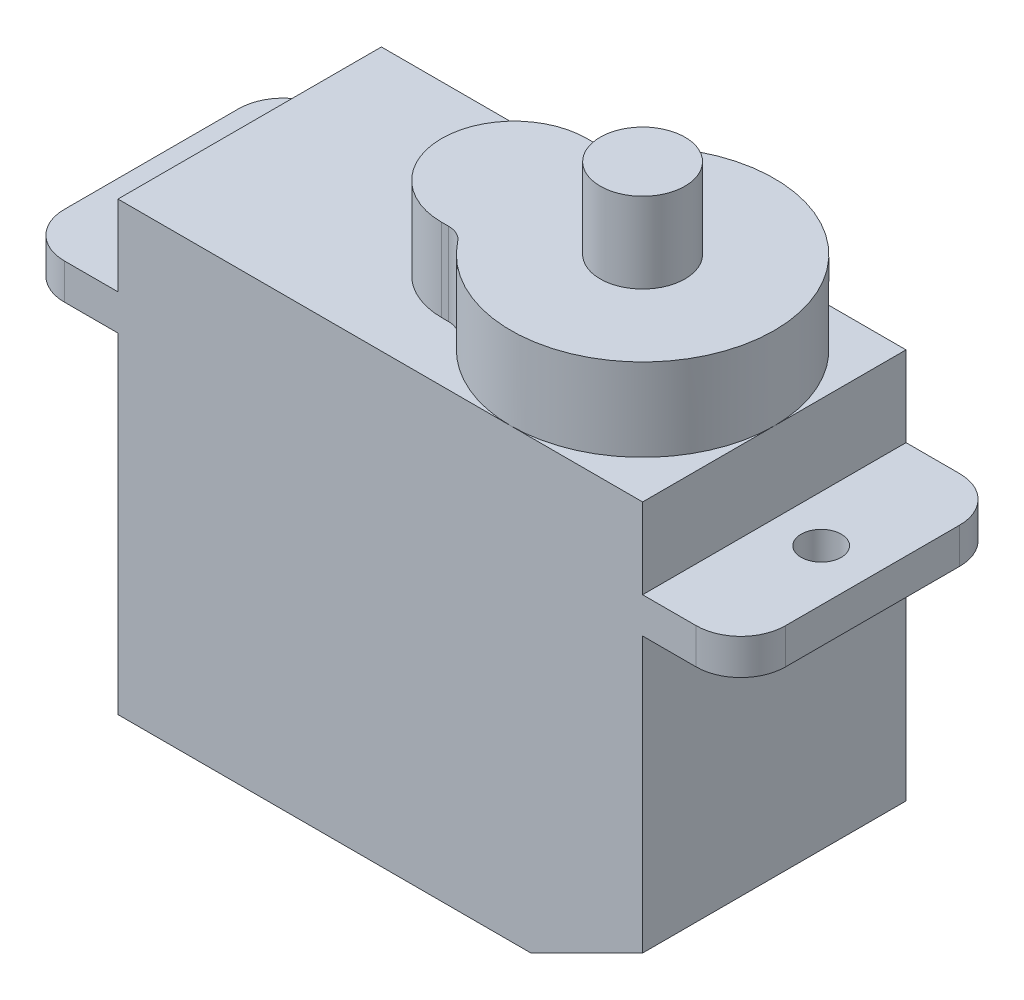
ISO-10303-21;
HEADER;
FILE_DESCRIPTION(('STEP AP214'),'2;1');
FILE_NAME('part.step','',(''),(''),'','','');
FILE_SCHEMA(('AUTOMOTIVE_DESIGN { 1 0 10303 214 1 1 1 1 }'));
ENDSEC;
DATA;
#1=APPLICATION_CONTEXT('core data for automotive mechanical design processes');
#2=APPLICATION_PROTOCOL_DEFINITION('international standard','automotive_design',2000,#1);
#3=PRODUCT_CONTEXT('',#1,'mechanical');
#4=PRODUCT('Part','Part','',(#3));
#5=PRODUCT_RELATED_PRODUCT_CATEGORY('part','',(#4));
#6=PRODUCT_DEFINITION_FORMATION('','',#4);
#7=PRODUCT_DEFINITION_CONTEXT('part definition',#1,'design');
#8=PRODUCT_DEFINITION('design','',#6,#7);
#9=PRODUCT_DEFINITION_SHAPE('','',#8);
#10=(LENGTH_UNIT() NAMED_UNIT(*) SI_UNIT(.MILLI.,.METRE.));
#11=(NAMED_UNIT(*) PLANE_ANGLE_UNIT() SI_UNIT($,.RADIAN.));
#12=(NAMED_UNIT(*) SI_UNIT($,.STERADIAN.) SOLID_ANGLE_UNIT());
#13=UNCERTAINTY_MEASURE_WITH_UNIT(LENGTH_MEASURE(1.E-05),#10,'distance_accuracy_value','');
#14=(GEOMETRIC_REPRESENTATION_CONTEXT(3) GLOBAL_UNCERTAINTY_ASSIGNED_CONTEXT((#13)) GLOBAL_UNIT_ASSIGNED_CONTEXT((#10,
#11,#12)) REPRESENTATION_CONTEXT('',''));
#15=CARTESIAN_POINT('',(0.,0.,0.));
#16=DIRECTION('',(0.,0.,1.));
#17=DIRECTION('',(1.,0.,0.));
#18=AXIS2_PLACEMENT_3D('',#15,#16,#17);
#19=CARTESIAN_POINT('',(0.,20.,11.8));
#20=DIRECTION('',(0.,1.,0.));
#21=DIRECTION('',(0.,0.,1.));
#22=AXIS2_PLACEMENT_3D('',#19,#20,#21);
#23=PLANE('',#22);
#24=CARTESIAN_POINT('',(12.1642387837581,20.,10.15));
#25=DIRECTION('',(0.,-1.,0.));
#26=DIRECTION('',(0.,0.,1.));
#27=AXIS2_PLACEMENT_3D('',#24,#25,#26);
#28=CIRCLE('',#27,1.);
#29=CARTESIAN_POINT('',(12.1642387837581,20.,9.15));
#30=VERTEX_POINT('',#29);
#31=CARTESIAN_POINT('',(12.9520302643728,20.,9.53405797101449));
#32=VERTEX_POINT('',#31);
#33=EDGE_CURVE('E50',#30,#32,#28,.T.);
#34=ORIENTED_EDGE('',*,*,#33,.F.);
#35=DIRECTION('',(1.,0.,0.));
#36=VECTOR('',#35,1.);
#37=CARTESIAN_POINT('',(11.85,20.,9.15));
#38=LINE('',#37,#36);
#39=CARTESIAN_POINT('',(11.85,20.,9.15));
#40=VERTEX_POINT('',#39);
#41=EDGE_CURVE('E54',#40,#30,#38,.T.);
#42=ORIENTED_EDGE('',*,*,#41,.F.);
#43=CARTESIAN_POINT('',(11.85,20.,5.9));
#44=DIRECTION('',(0.,1.,0.));
#45=DIRECTION('',(0.,0.,1.));
#46=AXIS2_PLACEMENT_3D('',#43,#44,#45);
#47=CIRCLE('',#46,3.25);
#48=CARTESIAN_POINT('',(11.85,20.,2.65));
#49=VERTEX_POINT('',#48);
#50=EDGE_CURVE('E741',#49,#40,#47,.T.);
#51=ORIENTED_EDGE('',*,*,#50,.F.);
#52=DIRECTION('',(-1.,0.,0.));
#53=VECTOR('',#52,1.);
#54=CARTESIAN_POINT('',(11.85,20.,2.65));
#55=LINE('',#54,#53);
#56=CARTESIAN_POINT('',(12.1642387837581,20.,2.65));
#57=VERTEX_POINT('',#56);
#58=EDGE_CURVE('E378',#57,#49,#55,.T.);
#59=ORIENTED_EDGE('',*,*,#58,.F.);
#60=CARTESIAN_POINT('',(12.1642387837581,20.,1.65));
#61=DIRECTION('',(0.,-1.,0.));
#62=DIRECTION('',(0.,0.,-1.));
#63=AXIS2_PLACEMENT_3D('',#60,#61,#62);
#64=CIRCLE('',#63,0.999999999999999);
#65=CARTESIAN_POINT('',(12.9520302643728,20.,2.26594202898551));
#66=VERTEX_POINT('',#65);
#67=EDGE_CURVE('E376',#66,#57,#64,.T.);
#68=ORIENTED_EDGE('',*,*,#67,.F.);
#69=CARTESIAN_POINT('',(17.6,20.,5.9));
#70=DIRECTION('',(0.,1.,0.));
#71=DIRECTION('',(0.,0.,1.));
#72=AXIS2_PLACEMENT_3D('',#69,#70,#71);
#73=CIRCLE('',#72,5.9);
#74=CARTESIAN_POINT('',(17.6,20.,0.));
#75=VERTEX_POINT('',#74);
#76=EDGE_CURVE('E370',#75,#66,#73,.T.);
#77=ORIENTED_EDGE('',*,*,#76,.F.);
#78=DIRECTION('',(1.,0.,0.));
#79=VECTOR('',#78,1.);
#80=CARTESIAN_POINT('',(0.,20.,0.));
#81=LINE('',#80,#79);
#82=CARTESIAN_POINT('',(0.,20.,0.));
#83=VERTEX_POINT('',#82);
#84=EDGE_CURVE('E275',#83,#75,#81,.T.);
#85=ORIENTED_EDGE('',*,*,#84,.F.);
#86=DIRECTION('',(0.,0.,-1.));
#87=VECTOR('',#86,1.);
#88=CARTESIAN_POINT('',(0.,20.,11.8));
#89=LINE('',#88,#87);
#90=CARTESIAN_POINT('',(0.,20.,11.8));
#91=VERTEX_POINT('',#90);
#92=EDGE_CURVE('E330',#91,#83,#89,.T.);
#93=ORIENTED_EDGE('',*,*,#92,.F.);
#94=DIRECTION('',(1.,0.,0.));
#95=VECTOR('',#94,1.);
#96=CARTESIAN_POINT('',(0.,20.,11.8));
#97=LINE('',#96,#95);
#98=CARTESIAN_POINT('',(17.6,20.,11.8));
#99=VERTEX_POINT('',#98);
#100=EDGE_CURVE('E242',#91,#99,#97,.T.);
#101=ORIENTED_EDGE('',*,*,#100,.T.);
#102=EDGE_CURVE('E43',#32,#99,#73,.T.);
#103=ORIENTED_EDGE('',*,*,#102,.F.);
#104=EDGE_LOOP('',(#34,#42,#51,#59,#68,#77,#85,#93,#101,#103));
#105=FACE_BOUND('',#104,.T.);
#106=ADVANCED_FACE('F32',(#105),#23,.T.);
#107=CARTESIAN_POINT('',(23.5,20.,5.9));
#108=VERTEX_POINT('',#107);
#109=EDGE_CURVE('E11',#99,#108,#73,.T.);
#110=ORIENTED_EDGE('',*,*,#109,.F.);
#111=CARTESIAN_POINT('',(23.5,20.,11.8));
#112=VERTEX_POINT('',#111);
#113=EDGE_CURVE('E241',#99,#112,#97,.T.);
#114=ORIENTED_EDGE('',*,*,#113,.T.);
#115=DIRECTION('',(0.,0.,-1.));
#116=VECTOR('',#115,1.);
#117=CARTESIAN_POINT('',(23.5,20.,11.8));
#118=LINE('',#117,#116);
#119=EDGE_CURVE('E326',#112,#108,#118,.T.);
#120=ORIENTED_EDGE('',*,*,#119,.T.);
#121=EDGE_LOOP('',(#110,#114,#120));
#122=FACE_BOUND('',#121,.T.);
#123=ADVANCED_FACE('F410',(#122),#23,.T.);
#124=CARTESIAN_POINT('',(-4.4,16.4,11.8));
#125=DIRECTION('',(0.,1.,0.));
#126=DIRECTION('',(0.,0.,1.));
#127=AXIS2_PLACEMENT_3D('',#124,#125,#126);
#128=PLANE('',#127);
#129=CARTESIAN_POINT('',(-2.1,16.4,5.9));
#130=DIRECTION('',(0.,1.,0.));
#131=DIRECTION('',(-1.,0.,0.));
#132=AXIS2_PLACEMENT_3D('',#129,#130,#131);
#133=CIRCLE('',#132,0.9);
#134=CARTESIAN_POINT('',(-3.,16.4,5.9));
#135=VERTEX_POINT('',#134);
#136=EDGE_CURVE('E231',#135,#135,#133,.T.);
#137=ORIENTED_EDGE('',*,*,#136,.F.);
#138=EDGE_LOOP('',(#137));
#139=FACE_BOUND('',#138,.T.);
#140=DIRECTION('',(0.,0.,-1.));
#141=VECTOR('',#140,1.);
#142=CARTESIAN_POINT('',(-4.4,16.4,11.8));
#143=LINE('',#142,#141);
#144=CARTESIAN_POINT('',(-4.4,16.4,9.8));
#145=VERTEX_POINT('',#144);
#146=CARTESIAN_POINT('',(-4.4,16.4,2.));
#147=VERTEX_POINT('',#146);
#148=EDGE_CURVE('E300',#145,#147,#143,.T.);
#149=ORIENTED_EDGE('',*,*,#148,.F.);
#150=CARTESIAN_POINT('',(-2.4,16.4,9.8));
#151=DIRECTION('',(0.,1.,0.));
#152=DIRECTION('',(0.,0.,1.));
#153=AXIS2_PLACEMENT_3D('',#150,#151,#152);
#154=CIRCLE('',#153,2.);
#155=CARTESIAN_POINT('',(-2.4,16.4,11.8));
#156=VERTEX_POINT('',#155);
#157=EDGE_CURVE('E365',#145,#156,#154,.T.);
#158=ORIENTED_EDGE('',*,*,#157,.T.);
#159=DIRECTION('',(1.,0.,0.));
#160=VECTOR('',#159,1.);
#161=CARTESIAN_POINT('',(-4.4,16.4,11.8));
#162=LINE('',#161,#160);
#163=CARTESIAN_POINT('',(0.,16.4,11.8));
#164=VERTEX_POINT('',#163);
#165=EDGE_CURVE('E235',#156,#164,#162,.T.);
#166=ORIENTED_EDGE('',*,*,#165,.T.);
#167=DIRECTION('',(0.,0.,-1.));
#168=VECTOR('',#167,1.);
#169=CARTESIAN_POINT('',(0.,16.4,11.8));
#170=LINE('',#169,#168);
#171=CARTESIAN_POINT('',(0.,16.4,0.));
#172=VERTEX_POINT('',#171);
#173=EDGE_CURVE('E268',#164,#172,#170,.T.);
#174=ORIENTED_EDGE('',*,*,#173,.T.);
#175=DIRECTION('',(1.,0.,0.));
#176=VECTOR('',#175,1.);
#177=CARTESIAN_POINT('',(-4.4,16.4,0.));
#178=LINE('',#177,#176);
#179=CARTESIAN_POINT('',(-2.4,16.4,0.));
#180=VERTEX_POINT('',#179);
#181=EDGE_CURVE('E269',#180,#172,#178,.T.);
#182=ORIENTED_EDGE('',*,*,#181,.F.);
#183=CARTESIAN_POINT('',(-2.4,16.4,2.));
#184=DIRECTION('',(0.,1.,0.));
#185=DIRECTION('',(0.,0.,1.));
#186=AXIS2_PLACEMENT_3D('',#183,#184,#185);
#187=CIRCLE('',#186,2.);
#188=EDGE_CURVE('E363',#180,#147,#187,.T.);
#189=ORIENTED_EDGE('',*,*,#188,.T.);
#190=EDGE_LOOP('',(#149,#158,#166,#174,#182,#189));
#191=FACE_BOUND('',#190,.T.);
#192=ADVANCED_FACE('F416',(#139,#191),#128,.T.);
#193=CARTESIAN_POINT('',(-4.4,14.8,11.8));
#194=DIRECTION('',(-1.,0.,0.));
#195=DIRECTION('',(0.,0.,1.));
#196=AXIS2_PLACEMENT_3D('',#193,#194,#195);
#197=PLANE('',#196);
#198=DIRECTION('',(0.,0.,-1.));
#199=VECTOR('',#198,1.);
#200=CARTESIAN_POINT('',(-4.4,14.8,11.8));
#201=LINE('',#200,#199);
#202=CARTESIAN_POINT('',(-4.4,14.8,9.8));
#203=VERTEX_POINT('',#202);
#204=CARTESIAN_POINT('',(-4.4,14.8,2.));
#205=VERTEX_POINT('',#204);
#206=EDGE_CURVE('E304',#203,#205,#201,.T.);
#207=ORIENTED_EDGE('',*,*,#206,.F.);
#208=DIRECTION('',(0.,1.,0.));
#209=VECTOR('',#208,1.);
#210=CARTESIAN_POINT('',(-4.4,14.8,9.8));
#211=LINE('',#210,#209);
#212=EDGE_CURVE('E360',#203,#145,#211,.T.);
#213=ORIENTED_EDGE('',*,*,#212,.T.);
#214=ORIENTED_EDGE('',*,*,#148,.T.);
#215=DIRECTION('',(0.,1.,0.));
#216=VECTOR('',#215,1.);
#217=CARTESIAN_POINT('',(-4.4,14.8,2.));
#218=LINE('',#217,#216);
#219=EDGE_CURVE('E358',#147,#205,#218,.F.);
#220=ORIENTED_EDGE('',*,*,#219,.T.);
#221=EDGE_LOOP('',(#207,#213,#214,#220));
#222=FACE_BOUND('',#221,.T.);
#223=ADVANCED_FACE('F456',(#222),#197,.T.);
#224=CARTESIAN_POINT('',(0.,14.8,11.8));
#225=DIRECTION('',(0.,-1.,0.));
#226=DIRECTION('',(0.,0.,-1.));
#227=AXIS2_PLACEMENT_3D('',#224,#225,#226);
#228=PLANE('',#227);
#229=CARTESIAN_POINT('',(-2.1,14.8,5.9));
#230=DIRECTION('',(0.,-1.,0.));
#231=DIRECTION('',(0.,0.,-1.));
#232=AXIS2_PLACEMENT_3D('',#229,#230,#231);
#233=CIRCLE('',#232,0.9);
#234=CARTESIAN_POINT('',(-2.1,14.8,5.00000000000001));
#235=VERTEX_POINT('',#234);
#236=EDGE_CURVE('E234',#235,#235,#233,.T.);
#237=ORIENTED_EDGE('',*,*,#236,.F.);
#238=EDGE_LOOP('',(#237));
#239=FACE_BOUND('',#238,.T.);
#240=DIRECTION('',(-1.,0.,0.));
#241=VECTOR('',#240,1.);
#242=CARTESIAN_POINT('',(0.,14.8,11.8));
#243=LINE('',#242,#241);
#244=CARTESIAN_POINT('',(0.,14.8,11.8));
#245=VERTEX_POINT('',#244);
#246=CARTESIAN_POINT('',(-2.4,14.8,11.8));
#247=VERTEX_POINT('',#246);
#248=EDGE_CURVE('E265',#245,#247,#243,.T.);
#249=ORIENTED_EDGE('',*,*,#248,.T.);
#250=CARTESIAN_POINT('',(-2.4,14.8,9.8));
#251=DIRECTION('',(0.,-1.,0.));
#252=DIRECTION('',(0.,0.,-1.));
#253=AXIS2_PLACEMENT_3D('',#250,#251,#252);
#254=CIRCLE('',#253,2.);
#255=EDGE_CURVE('E36',#247,#203,#254,.T.);
#256=ORIENTED_EDGE('',*,*,#255,.T.);
#257=ORIENTED_EDGE('',*,*,#206,.T.);
#258=CARTESIAN_POINT('',(-2.4,14.8,2.));
#259=DIRECTION('',(0.,-1.,0.));
#260=DIRECTION('',(0.,0.,-1.));
#261=AXIS2_PLACEMENT_3D('',#258,#259,#260);
#262=CIRCLE('',#261,2.);
#263=CARTESIAN_POINT('',(-2.4,14.8,0.));
#264=VERTEX_POINT('',#263);
#265=EDGE_CURVE('E366',#205,#264,#262,.T.);
#266=ORIENTED_EDGE('',*,*,#265,.T.);
#267=DIRECTION('',(-1.,0.,0.));
#268=VECTOR('',#267,1.);
#269=CARTESIAN_POINT('',(0.,14.8,0.));
#270=LINE('',#269,#268);
#271=CARTESIAN_POINT('',(0.,14.8,0.));
#272=VERTEX_POINT('',#271);
#273=EDGE_CURVE('E238',#272,#264,#270,.T.);
#274=ORIENTED_EDGE('',*,*,#273,.F.);
#275=DIRECTION('',(0.,0.,-1.));
#276=VECTOR('',#275,1.);
#277=CARTESIAN_POINT('',(0.,14.8,11.8));
#278=LINE('',#277,#276);
#279=EDGE_CURVE('E307',#245,#272,#278,.T.);
#280=ORIENTED_EDGE('',*,*,#279,.F.);
#281=EDGE_LOOP('',(#249,#256,#257,#266,#274,#280));
#282=FACE_BOUND('',#281,.T.);
#283=ADVANCED_FACE('F464',(#239,#282),#228,.T.);
#284=CARTESIAN_POINT('',(0.,0.,11.8));
#285=DIRECTION('',(-1.,0.,0.));
#286=DIRECTION('',(0.,0.,1.));
#287=AXIS2_PLACEMENT_3D('',#284,#285,#286);
#288=PLANE('',#287);
#289=DIRECTION('',(0.,1.,0.));
#290=VECTOR('',#289,1.);
#291=CARTESIAN_POINT('',(0.,0.,0.));
#292=LINE('',#291,#290);
#293=CARTESIAN_POINT('',(0.,0.,0.));
#294=VERTEX_POINT('',#293);
#295=EDGE_CURVE('E295',#294,#272,#292,.T.);
#296=ORIENTED_EDGE('',*,*,#295,.F.);
#297=DIRECTION('',(0.,0.,-1.));
#298=VECTOR('',#297,1.);
#299=CARTESIAN_POINT('',(0.,0.,11.8));
#300=LINE('',#299,#298);
#301=CARTESIAN_POINT('',(0.,0.,11.8));
#302=VERTEX_POINT('',#301);
#303=EDGE_CURVE('E309',#302,#294,#300,.T.);
#304=ORIENTED_EDGE('',*,*,#303,.F.);
#305=DIRECTION('',(0.,1.,0.));
#306=VECTOR('',#305,1.);
#307=CARTESIAN_POINT('',(0.,0.,11.8));
#308=LINE('',#307,#306);
#309=EDGE_CURVE('E262',#302,#245,#308,.T.);
#310=ORIENTED_EDGE('',*,*,#309,.T.);
#311=ORIENTED_EDGE('',*,*,#279,.T.);
#312=EDGE_LOOP('',(#296,#304,#310,#311));
#313=FACE_BOUND('',#312,.T.);
#314=ADVANCED_FACE('F468',(#313),#288,.T.);
#315=CARTESIAN_POINT('',(18.5,0.,11.8));
#316=DIRECTION('',(0.,-1.,0.));
#317=DIRECTION('',(0.,0.,-1.));
#318=AXIS2_PLACEMENT_3D('',#315,#316,#317);
#319=PLANE('',#318);
#320=DIRECTION('',(-1.,0.,0.));
#321=VECTOR('',#320,1.);
#322=CARTESIAN_POINT('',(18.5,0.,0.));
#323=LINE('',#322,#321);
#324=CARTESIAN_POINT('',(18.5,0.,0.));
#325=VERTEX_POINT('',#324);
#326=EDGE_CURVE('E292',#325,#294,#323,.T.);
#327=ORIENTED_EDGE('',*,*,#326,.F.);
#328=DIRECTION('',(0.,0.,-1.));
#329=VECTOR('',#328,1.);
#330=CARTESIAN_POINT('',(18.5,0.,11.8));
#331=LINE('',#330,#329);
#332=CARTESIAN_POINT('',(18.5,0.,11.8));
#333=VERTEX_POINT('',#332);
#334=EDGE_CURVE('E311',#333,#325,#331,.T.);
#335=ORIENTED_EDGE('',*,*,#334,.F.);
#336=DIRECTION('',(-1.,0.,0.));
#337=VECTOR('',#336,1.);
#338=CARTESIAN_POINT('',(18.5,0.,11.8));
#339=LINE('',#338,#337);
#340=EDGE_CURVE('E259',#333,#302,#339,.T.);
#341=ORIENTED_EDGE('',*,*,#340,.T.);
#342=ORIENTED_EDGE('',*,*,#303,.T.);
#343=EDGE_LOOP('',(#327,#335,#341,#342));
#344=FACE_BOUND('',#343,.T.);
#345=ADVANCED_FACE('F471',(#344),#319,.T.);
#346=CARTESIAN_POINT('',(23.5,2.5,11.8));
#347=DIRECTION('',(0.447213595499958,-0.894427190999916,0.));
#348=DIRECTION('',(0.894427190999916,0.447213595499958,0.));
#349=AXIS2_PLACEMENT_3D('',#346,#347,#348);
#350=PLANE('',#349);
#351=DIRECTION('',(-0.894427190999916,-0.447213595499958,0.));
#352=VECTOR('',#351,1.);
#353=CARTESIAN_POINT('',(23.5,2.5,0.));
#354=LINE('',#353,#352);
#355=CARTESIAN_POINT('',(23.5,2.5,0.));
#356=VERTEX_POINT('',#355);
#357=EDGE_CURVE('E289',#356,#325,#354,.T.);
#358=ORIENTED_EDGE('',*,*,#357,.F.);
#359=DIRECTION('',(0.,0.,-1.));
#360=VECTOR('',#359,1.);
#361=CARTESIAN_POINT('',(23.5,2.5,11.8));
#362=LINE('',#361,#360);
#363=CARTESIAN_POINT('',(23.5,2.5,11.8));
#364=VERTEX_POINT('',#363);
#365=EDGE_CURVE('E313',#364,#356,#362,.T.);
#366=ORIENTED_EDGE('',*,*,#365,.F.);
#367=DIRECTION('',(-0.894427190999916,-0.447213595499958,0.));
#368=VECTOR('',#367,1.);
#369=CARTESIAN_POINT('',(23.5,2.5,11.8));
#370=LINE('',#369,#368);
#371=EDGE_CURVE('E256',#364,#333,#370,.T.);
#372=ORIENTED_EDGE('',*,*,#371,.T.);
#373=ORIENTED_EDGE('',*,*,#334,.T.);
#374=EDGE_LOOP('',(#358,#366,#372,#373));
#375=FACE_BOUND('',#374,.T.);
#376=ADVANCED_FACE('F476',(#375),#350,.T.);
#377=CARTESIAN_POINT('',(23.5,14.8,11.8));
#378=DIRECTION('',(1.,0.,0.));
#379=DIRECTION('',(0.,1.,0.));
#380=AXIS2_PLACEMENT_3D('',#377,#378,#379);
#381=PLANE('',#380);
#382=DIRECTION('',(0.,-1.,0.));
#383=VECTOR('',#382,1.);
#384=CARTESIAN_POINT('',(23.5,14.8,0.));
#385=LINE('',#384,#383);
#386=CARTESIAN_POINT('',(23.5,14.8,0.));
#387=VERTEX_POINT('',#386);
#388=EDGE_CURVE('E286',#387,#356,#385,.T.);
#389=ORIENTED_EDGE('',*,*,#388,.F.);
#390=DIRECTION('',(0.,0.,-1.));
#391=VECTOR('',#390,1.);
#392=CARTESIAN_POINT('',(23.5,14.8,11.8));
#393=LINE('',#392,#391);
#394=CARTESIAN_POINT('',(23.5,14.8,11.8));
#395=VERTEX_POINT('',#394);
#396=EDGE_CURVE('E315',#395,#387,#393,.T.);
#397=ORIENTED_EDGE('',*,*,#396,.F.);
#398=DIRECTION('',(0.,-1.,0.));
#399=VECTOR('',#398,1.);
#400=CARTESIAN_POINT('',(23.5,14.8,11.8));
#401=LINE('',#400,#399);
#402=EDGE_CURVE('E253',#395,#364,#401,.T.);
#403=ORIENTED_EDGE('',*,*,#402,.T.);
#404=ORIENTED_EDGE('',*,*,#365,.T.);
#405=EDGE_LOOP('',(#389,#397,#403,#404));
#406=FACE_BOUND('',#405,.T.);
#407=ADVANCED_FACE('F479',(#406),#381,.T.);
#408=CARTESIAN_POINT('',(27.9,14.8,11.8));
#409=DIRECTION('',(0.,-1.,0.));
#410=DIRECTION('',(0.,0.,-1.));
#411=AXIS2_PLACEMENT_3D('',#408,#409,#410);
#412=PLANE('',#411);
#413=CARTESIAN_POINT('',(25.6,14.8,5.9));
#414=DIRECTION('',(0.,-1.,0.));
#415=DIRECTION('',(0.,0.,-1.));
#416=AXIS2_PLACEMENT_3D('',#413,#414,#415);
#417=CIRCLE('',#416,0.9);
#418=CARTESIAN_POINT('',(25.6,14.8,5.));
#419=VERTEX_POINT('',#418);
#420=EDGE_CURVE('E223',#419,#419,#417,.T.);
#421=ORIENTED_EDGE('',*,*,#420,.F.);
#422=EDGE_LOOP('',(#421));
#423=FACE_BOUND('',#422,.T.);
#424=DIRECTION('',(0.,0.,-1.));
#425=VECTOR('',#424,1.);
#426=CARTESIAN_POINT('',(27.9,14.8,11.8));
#427=LINE('',#426,#425);
#428=CARTESIAN_POINT('',(27.9,14.8,9.8));
#429=VERTEX_POINT('',#428);
#430=CARTESIAN_POINT('',(27.9,14.8,2.));
#431=VERTEX_POINT('',#430);
#432=EDGE_CURVE('E318',#429,#431,#427,.T.);
#433=ORIENTED_EDGE('',*,*,#432,.F.);
#434=CARTESIAN_POINT('',(25.9,14.8,9.8));
#435=DIRECTION('',(0.,-1.,0.));
#436=DIRECTION('',(0.,0.,-1.));
#437=AXIS2_PLACEMENT_3D('',#434,#435,#436);
#438=CIRCLE('',#437,2.);
#439=CARTESIAN_POINT('',(25.9,14.8,11.8));
#440=VERTEX_POINT('',#439);
#441=EDGE_CURVE('E342',#429,#440,#438,.T.);
#442=ORIENTED_EDGE('',*,*,#441,.T.);
#443=DIRECTION('',(-1.,0.,0.));
#444=VECTOR('',#443,1.);
#445=CARTESIAN_POINT('',(27.9,14.8,11.8));
#446=LINE('',#445,#444);
#447=EDGE_CURVE('E251',#440,#395,#446,.T.);
#448=ORIENTED_EDGE('',*,*,#447,.T.);
#449=ORIENTED_EDGE('',*,*,#396,.T.);
#450=DIRECTION('',(-1.,0.,0.));
#451=VECTOR('',#450,1.);
#452=CARTESIAN_POINT('',(27.9,14.8,0.));
#453=LINE('',#452,#451);
#454=CARTESIAN_POINT('',(25.9,14.8,0.));
#455=VERTEX_POINT('',#454);
#456=EDGE_CURVE('E284',#455,#387,#453,.T.);
#457=ORIENTED_EDGE('',*,*,#456,.F.);
#458=CARTESIAN_POINT('',(25.9,14.8,2.));
#459=DIRECTION('',(0.,-1.,0.));
#460=DIRECTION('',(0.,0.,-1.));
#461=AXIS2_PLACEMENT_3D('',#458,#459,#460);
#462=CIRCLE('',#461,2.);
#463=EDGE_CURVE('E340',#455,#431,#462,.T.);
#464=ORIENTED_EDGE('',*,*,#463,.T.);
#465=EDGE_LOOP('',(#433,#442,#448,#449,#457,#464));
#466=FACE_BOUND('',#465,.T.);
#467=ADVANCED_FACE('F499',(#423,#466),#412,.T.);
#468=CARTESIAN_POINT('',(27.9,16.4,11.8));
#469=DIRECTION('',(1.,0.,0.));
#470=DIRECTION('',(0.,0.,-1.));
#471=AXIS2_PLACEMENT_3D('',#468,#469,#470);
#472=PLANE('',#471);
#473=DIRECTION('',(0.,0.,-1.));
#474=VECTOR('',#473,1.);
#475=CARTESIAN_POINT('',(27.9,16.4,11.8));
#476=LINE('',#475,#474);
#477=CARTESIAN_POINT('',(27.9,16.4,9.8));
#478=VERTEX_POINT('',#477);
#479=CARTESIAN_POINT('',(27.9,16.4,2.));
#480=VERTEX_POINT('',#479);
#481=EDGE_CURVE('E321',#478,#480,#476,.T.);
#482=ORIENTED_EDGE('',*,*,#481,.F.);
#483=DIRECTION('',(0.,-1.,0.));
#484=VECTOR('',#483,1.);
#485=CARTESIAN_POINT('',(27.9,16.4,9.8));
#486=LINE('',#485,#484);
#487=EDGE_CURVE('E337',#478,#429,#486,.T.);
#488=ORIENTED_EDGE('',*,*,#487,.T.);
#489=ORIENTED_EDGE('',*,*,#432,.T.);
#490=DIRECTION('',(0.,-1.,0.));
#491=VECTOR('',#490,1.);
#492=CARTESIAN_POINT('',(27.9,16.4,2.));
#493=LINE('',#492,#491);
#494=EDGE_CURVE('E303',#431,#480,#493,.F.);
#495=ORIENTED_EDGE('',*,*,#494,.T.);
#496=EDGE_LOOP('',(#482,#488,#489,#495));
#497=FACE_BOUND('',#496,.T.);
#498=ADVANCED_FACE('F491',(#497),#472,.T.);
#499=CARTESIAN_POINT('',(23.5,16.4,11.8));
#500=DIRECTION('',(0.,1.,0.));
#501=DIRECTION('',(-1.,0.,0.));
#502=AXIS2_PLACEMENT_3D('',#499,#500,#501);
#503=PLANE('',#502);
#504=CARTESIAN_POINT('',(25.6,16.4,5.9));
#505=DIRECTION('',(0.,1.,0.));
#506=DIRECTION('',(-1.,0.,0.));
#507=AXIS2_PLACEMENT_3D('',#504,#505,#506);
#508=CIRCLE('',#507,0.9);
#509=CARTESIAN_POINT('',(24.7,16.4,5.9));
#510=VERTEX_POINT('',#509);
#511=EDGE_CURVE('E220',#510,#510,#508,.T.);
#512=ORIENTED_EDGE('',*,*,#511,.F.);
#513=EDGE_LOOP('',(#512));
#514=FACE_BOUND('',#513,.T.);
#515=DIRECTION('',(1.,0.,0.));
#516=VECTOR('',#515,1.);
#517=CARTESIAN_POINT('',(23.5,16.4,11.8));
#518=LINE('',#517,#516);
#519=CARTESIAN_POINT('',(23.5,16.4,11.8));
#520=VERTEX_POINT('',#519);
#521=CARTESIAN_POINT('',(25.9,16.4,11.8));
#522=VERTEX_POINT('',#521);
#523=EDGE_CURVE('E248',#520,#522,#518,.T.);
#524=ORIENTED_EDGE('',*,*,#523,.T.);
#525=CARTESIAN_POINT('',(25.9,16.4,9.8));
#526=DIRECTION('',(0.,1.,0.));
#527=DIRECTION('',(-1.,0.,0.));
#528=AXIS2_PLACEMENT_3D('',#525,#526,#527);
#529=CIRCLE('',#528,2.);
#530=EDGE_CURVE('E350',#522,#478,#529,.T.);
#531=ORIENTED_EDGE('',*,*,#530,.T.);
#532=ORIENTED_EDGE('',*,*,#481,.T.);
#533=CARTESIAN_POINT('',(25.9,16.4,2.));
#534=DIRECTION('',(0.,1.,0.));
#535=DIRECTION('',(-1.,0.,0.));
#536=AXIS2_PLACEMENT_3D('',#533,#534,#535);
#537=CIRCLE('',#536,2.);
#538=CARTESIAN_POINT('',(25.9,16.4,0.));
#539=VERTEX_POINT('',#538);
#540=EDGE_CURVE('E348',#480,#539,#537,.T.);
#541=ORIENTED_EDGE('',*,*,#540,.T.);
#542=DIRECTION('',(1.,0.,0.));
#543=VECTOR('',#542,1.);
#544=CARTESIAN_POINT('',(23.5,16.4,0.));
#545=LINE('',#544,#543);
#546=CARTESIAN_POINT('',(23.5,16.4,0.));
#547=VERTEX_POINT('',#546);
#548=EDGE_CURVE('E281',#547,#539,#545,.T.);
#549=ORIENTED_EDGE('',*,*,#548,.F.);
#550=DIRECTION('',(0.,0.,-1.));
#551=VECTOR('',#550,1.);
#552=CARTESIAN_POINT('',(23.5,16.4,11.8));
#553=LINE('',#552,#551);
#554=EDGE_CURVE('E324',#520,#547,#553,.T.);
#555=ORIENTED_EDGE('',*,*,#554,.F.);
#556=EDGE_LOOP('',(#524,#531,#532,#541,#549,#555));
#557=FACE_BOUND('',#556,.T.);
#558=ADVANCED_FACE('F430',(#514,#557),#503,.T.);
#559=CARTESIAN_POINT('',(23.5,20.,11.8));
#560=DIRECTION('',(1.,0.,0.));
#561=DIRECTION('',(0.,0.,-1.));
#562=AXIS2_PLACEMENT_3D('',#559,#560,#561);
#563=PLANE('',#562);
#564=DIRECTION('',(0.,-1.,0.));
#565=VECTOR('',#564,1.);
#566=CARTESIAN_POINT('',(23.5,20.,0.));
#567=LINE('',#566,#565);
#568=CARTESIAN_POINT('',(23.5,20.,0.));
#569=VERTEX_POINT('',#568);
#570=EDGE_CURVE('E278',#569,#547,#567,.T.);
#571=ORIENTED_EDGE('',*,*,#570,.F.);
#572=EDGE_CURVE('E329',#108,#569,#118,.T.);
#573=ORIENTED_EDGE('',*,*,#572,.F.);
#574=ORIENTED_EDGE('',*,*,#119,.F.);
#575=DIRECTION('',(0.,-1.,0.));
#576=VECTOR('',#575,1.);
#577=CARTESIAN_POINT('',(23.5,20.,11.8));
#578=LINE('',#577,#576);
#579=EDGE_CURVE('E245',#112,#520,#578,.T.);
#580=ORIENTED_EDGE('',*,*,#579,.T.);
#581=ORIENTED_EDGE('',*,*,#554,.T.);
#582=EDGE_LOOP('',(#571,#573,#574,#580,#581));
#583=FACE_BOUND('',#582,.T.);
#584=ADVANCED_FACE('F422',(#583),#563,.T.);
#585=EDGE_CURVE('E41',#108,#75,#73,.T.);
#586=ORIENTED_EDGE('',*,*,#585,.F.);
#587=ORIENTED_EDGE('',*,*,#572,.T.);
#588=EDGE_CURVE('E274',#75,#569,#81,.T.);
#589=ORIENTED_EDGE('',*,*,#588,.F.);
#590=EDGE_LOOP('',(#586,#587,#589));
#591=FACE_BOUND('',#590,.T.);
#592=ADVANCED_FACE('F412',(#591),#23,.T.);
#593=CARTESIAN_POINT('',(0.,16.4,11.8));
#594=DIRECTION('',(-1.,0.,0.));
#595=DIRECTION('',(0.,0.,1.));
#596=AXIS2_PLACEMENT_3D('',#593,#594,#595);
#597=PLANE('',#596);
#598=DIRECTION('',(0.,1.,0.));
#599=VECTOR('',#598,1.);
#600=CARTESIAN_POINT('',(0.,16.4,0.));
#601=LINE('',#600,#599);
#602=EDGE_CURVE('E271',#172,#83,#601,.T.);
#603=ORIENTED_EDGE('',*,*,#602,.F.);
#604=ORIENTED_EDGE('',*,*,#173,.F.);
#605=DIRECTION('',(0.,1.,0.));
#606=VECTOR('',#605,1.);
#607=CARTESIAN_POINT('',(0.,16.4,11.8));
#608=LINE('',#607,#606);
#609=EDGE_CURVE('E237',#164,#91,#608,.T.);
#610=ORIENTED_EDGE('',*,*,#609,.T.);
#611=ORIENTED_EDGE('',*,*,#92,.T.);
#612=EDGE_LOOP('',(#603,#604,#610,#611));
#613=FACE_BOUND('',#612,.T.);
#614=ADVANCED_FACE('F421',(#613),#597,.T.);
#615=CARTESIAN_POINT('',(0.,0.,11.8));
#616=DIRECTION('',(0.,0.,1.));
#617=DIRECTION('',(1.,0.,0.));
#618=AXIS2_PLACEMENT_3D('',#615,#616,#617);
#619=PLANE('',#618);
#620=ORIENTED_EDGE('',*,*,#447,.F.);
#621=DIRECTION('',(0.,-1.,0.));
#622=VECTOR('',#621,1.);
#623=CARTESIAN_POINT('',(25.9,0.,11.8));
#624=LINE('',#623,#622);
#625=EDGE_CURVE('E346',#440,#522,#624,.F.);
#626=ORIENTED_EDGE('',*,*,#625,.T.);
#627=ORIENTED_EDGE('',*,*,#523,.F.);
#628=ORIENTED_EDGE('',*,*,#579,.F.);
#629=ORIENTED_EDGE('',*,*,#113,.F.);
#630=ORIENTED_EDGE('',*,*,#100,.F.);
#631=ORIENTED_EDGE('',*,*,#609,.F.);
#632=ORIENTED_EDGE('',*,*,#165,.F.);
#633=DIRECTION('',(0.,1.,0.));
#634=VECTOR('',#633,1.);
#635=CARTESIAN_POINT('',(-2.4,0.,11.8));
#636=LINE('',#635,#634);
#637=EDGE_CURVE('E344',#156,#247,#636,.F.);
#638=ORIENTED_EDGE('',*,*,#637,.T.);
#639=ORIENTED_EDGE('',*,*,#248,.F.);
#640=ORIENTED_EDGE('',*,*,#309,.F.);
#641=ORIENTED_EDGE('',*,*,#340,.F.);
#642=ORIENTED_EDGE('',*,*,#371,.F.);
#643=ORIENTED_EDGE('',*,*,#402,.F.);
#644=EDGE_LOOP('',(#620,#626,#627,#628,#629,#630,#631,#632,#638,#639,#640,#641,#642,#643));
#645=FACE_BOUND('',#644,.T.);
#646=ADVANCED_FACE('F428',(#645),#619,.T.);
#647=CARTESIAN_POINT('',(0.,0.,0.));
#648=DIRECTION('',(0.,0.,1.));
#649=DIRECTION('',(1.,0.,0.));
#650=AXIS2_PLACEMENT_3D('',#647,#648,#649);
#651=PLANE('',#650);
#652=ORIENTED_EDGE('',*,*,#548,.T.);
#653=DIRECTION('',(0.,-1.,0.));
#654=VECTOR('',#653,1.);
#655=CARTESIAN_POINT('',(25.9,14.8,0.));
#656=LINE('',#655,#654);
#657=EDGE_CURVE('E355',#539,#455,#656,.T.);
#658=ORIENTED_EDGE('',*,*,#657,.T.);
#659=ORIENTED_EDGE('',*,*,#456,.T.);
#660=ORIENTED_EDGE('',*,*,#388,.T.);
#661=ORIENTED_EDGE('',*,*,#357,.T.);
#662=ORIENTED_EDGE('',*,*,#326,.T.);
#663=ORIENTED_EDGE('',*,*,#295,.T.);
#664=ORIENTED_EDGE('',*,*,#273,.T.);
#665=DIRECTION('',(0.,1.,0.));
#666=VECTOR('',#665,1.);
#667=CARTESIAN_POINT('',(-2.4,16.4,0.));
#668=LINE('',#667,#666);
#669=EDGE_CURVE('E352',#264,#180,#668,.T.);
#670=ORIENTED_EDGE('',*,*,#669,.T.);
#671=ORIENTED_EDGE('',*,*,#181,.T.);
#672=ORIENTED_EDGE('',*,*,#602,.T.);
#673=ORIENTED_EDGE('',*,*,#84,.T.);
#674=ORIENTED_EDGE('',*,*,#588,.T.);
#675=ORIENTED_EDGE('',*,*,#570,.T.);
#676=EDGE_LOOP('',(#652,#658,#659,#660,#661,#662,#663,#664,#670,#671,#672,#673,#674,#675));
#677=FACE_BOUND('',#676,.T.);
#678=ADVANCED_FACE('F462',(#677),#651,.F.);
#679=CARTESIAN_POINT('',(-2.09999999999999,4.59999999999998,5.9));
#680=DIRECTION('',(0.,1.,0.));
#681=DIRECTION('',(-1.,0.,0.));
#682=AXIS2_PLACEMENT_3D('',#679,#680,#681);
#683=CYLINDRICAL_SURFACE('',#682,0.9);
#684=ORIENTED_EDGE('',*,*,#236,.T.);
#685=EDGE_LOOP('',(#684));
#686=FACE_BOUND('',#685,.T.);
#687=ORIENTED_EDGE('',*,*,#136,.T.);
#688=EDGE_LOOP('',(#687));
#689=FACE_BOUND('',#688,.T.);
#690=ADVANCED_FACE('F520',(#686,#689),#683,.F.);
#691=CARTESIAN_POINT('',(25.6,4.6,5.9));
#692=DIRECTION('',(0.,1.,0.));
#693=DIRECTION('',(-1.,0.,0.));
#694=AXIS2_PLACEMENT_3D('',#691,#692,#693);
#695=CYLINDRICAL_SURFACE('',#694,0.9);
#696=ORIENTED_EDGE('',*,*,#420,.T.);
#697=EDGE_LOOP('',(#696));
#698=FACE_BOUND('',#697,.T.);
#699=ORIENTED_EDGE('',*,*,#511,.T.);
#700=EDGE_LOOP('',(#699));
#701=FACE_BOUND('',#700,.T.);
#702=ADVANCED_FACE('F518',(#698,#701),#695,.F.);
#703=CARTESIAN_POINT('',(25.9,16.4,9.8));
#704=DIRECTION('',(0.,-1.,0.));
#705=DIRECTION('',(0.,0.,-1.));
#706=AXIS2_PLACEMENT_3D('',#703,#704,#705);
#707=CYLINDRICAL_SURFACE('',#706,2.);
#708=ORIENTED_EDGE('',*,*,#530,.F.);
#709=ORIENTED_EDGE('',*,*,#625,.F.);
#710=ORIENTED_EDGE('',*,*,#441,.F.);
#711=ORIENTED_EDGE('',*,*,#487,.F.);
#712=EDGE_LOOP('',(#708,#709,#710,#711));
#713=FACE_BOUND('',#712,.T.);
#714=ADVANCED_FACE('F485',(#713),#707,.T.);
#715=CARTESIAN_POINT('',(25.9,0.,2.));
#716=DIRECTION('',(0.,1.,0.));
#717=DIRECTION('',(0.,0.,1.));
#718=AXIS2_PLACEMENT_3D('',#715,#716,#717);
#719=CYLINDRICAL_SURFACE('',#718,2.);
#720=ORIENTED_EDGE('',*,*,#540,.F.);
#721=ORIENTED_EDGE('',*,*,#494,.F.);
#722=ORIENTED_EDGE('',*,*,#463,.F.);
#723=ORIENTED_EDGE('',*,*,#657,.F.);
#724=EDGE_LOOP('',(#720,#721,#722,#723));
#725=FACE_BOUND('',#724,.T.);
#726=ADVANCED_FACE('F495',(#725),#719,.T.);
#727=CARTESIAN_POINT('',(-2.4,14.8,9.8));
#728=DIRECTION('',(0.,1.,0.));
#729=DIRECTION('',(0.,0.,1.));
#730=AXIS2_PLACEMENT_3D('',#727,#728,#729);
#731=CYLINDRICAL_SURFACE('',#730,2.);
#732=ORIENTED_EDGE('',*,*,#255,.F.);
#733=ORIENTED_EDGE('',*,*,#637,.F.);
#734=ORIENTED_EDGE('',*,*,#157,.F.);
#735=ORIENTED_EDGE('',*,*,#212,.F.);
#736=EDGE_LOOP('',(#732,#733,#734,#735));
#737=FACE_BOUND('',#736,.T.);
#738=ADVANCED_FACE('F452',(#737),#731,.T.);
#739=CARTESIAN_POINT('',(-2.4,0.,2.));
#740=DIRECTION('',(0.,-1.,0.));
#741=DIRECTION('',(0.,0.,-1.));
#742=AXIS2_PLACEMENT_3D('',#739,#740,#741);
#743=CYLINDRICAL_SURFACE('',#742,2.);
#744=ORIENTED_EDGE('',*,*,#265,.F.);
#745=ORIENTED_EDGE('',*,*,#219,.F.);
#746=ORIENTED_EDGE('',*,*,#188,.F.);
#747=ORIENTED_EDGE('',*,*,#669,.F.);
#748=EDGE_LOOP('',(#744,#745,#746,#747));
#749=FACE_BOUND('',#748,.T.);
#750=ADVANCED_FACE('F34',(#749),#743,.T.);
#751=CARTESIAN_POINT('',(12.1642387837581,23.7,10.15));
#752=DIRECTION('',(0.,-1.,0.));
#753=DIRECTION('',(0.,0.,-1.));
#754=AXIS2_PLACEMENT_3D('',#751,#752,#753);
#755=CYLINDRICAL_SURFACE('',#754,1.);
#756=ORIENTED_EDGE('',*,*,#33,.T.);
#757=DIRECTION('',(0.,-1.,0.));
#758=VECTOR('',#757,1.);
#759=CARTESIAN_POINT('',(12.9520302643728,23.7,9.53405797101449));
#760=LINE('',#759,#758);
#761=CARTESIAN_POINT('',(12.9520302643728,23.7,9.53405797101449));
#762=VERTEX_POINT('',#761);
#763=EDGE_CURVE('E202',#762,#32,#760,.T.);
#764=ORIENTED_EDGE('',*,*,#763,.F.);
#765=CARTESIAN_POINT('',(12.1642387837581,23.7,10.15));
#766=DIRECTION('',(0.,-1.,0.));
#767=DIRECTION('',(0.,0.,1.));
#768=AXIS2_PLACEMENT_3D('',#765,#766,#767);
#769=CIRCLE('',#768,1.);
#770=CARTESIAN_POINT('',(12.1642387837581,23.7,9.15));
#771=VERTEX_POINT('',#770);
#772=EDGE_CURVE('E209',#771,#762,#769,.T.);
#773=ORIENTED_EDGE('',*,*,#772,.F.);
#774=DIRECTION('',(0.,-1.,0.));
#775=VECTOR('',#774,1.);
#776=CARTESIAN_POINT('',(12.1642387837581,23.7,9.15));
#777=LINE('',#776,#775);
#778=EDGE_CURVE('E385',#771,#30,#777,.T.);
#779=ORIENTED_EDGE('',*,*,#778,.T.);
#780=EDGE_LOOP('',(#756,#764,#773,#779));
#781=FACE_BOUND('',#780,.T.);
#782=ADVANCED_FACE('F219',(#781),#755,.F.);
#783=CARTESIAN_POINT('',(17.6,23.7,5.9));
#784=DIRECTION('',(0.,-1.,0.));
#785=DIRECTION('',(0.,0.,-1.));
#786=AXIS2_PLACEMENT_3D('',#783,#784,#785);
#787=CYLINDRICAL_SURFACE('',#786,5.9);
#788=ORIENTED_EDGE('',*,*,#102,.T.);
#789=ORIENTED_EDGE('',*,*,#109,.T.);
#790=ORIENTED_EDGE('',*,*,#585,.T.);
#791=ORIENTED_EDGE('',*,*,#76,.T.);
#792=DIRECTION('',(0.,-1.,0.));
#793=VECTOR('',#792,1.);
#794=CARTESIAN_POINT('',(12.9520302643728,23.7,2.26594202898551));
#795=LINE('',#794,#793);
#796=CARTESIAN_POINT('',(12.9520302643728,23.7,2.26594202898551));
#797=VERTEX_POINT('',#796);
#798=EDGE_CURVE('E205',#797,#66,#795,.T.);
#799=ORIENTED_EDGE('',*,*,#798,.F.);
#800=CARTESIAN_POINT('',(17.6,23.7,5.9));
#801=DIRECTION('',(0.,1.,0.));
#802=DIRECTION('',(0.,0.,1.));
#803=AXIS2_PLACEMENT_3D('',#800,#801,#802);
#804=CIRCLE('',#803,5.9);
#805=EDGE_CURVE('E197',#762,#797,#804,.T.);
#806=ORIENTED_EDGE('',*,*,#805,.F.);
#807=ORIENTED_EDGE('',*,*,#763,.T.);
#808=EDGE_LOOP('',(#788,#789,#790,#791,#799,#806,#807));
#809=FACE_BOUND('',#808,.T.);
#810=ADVANCED_FACE('F200',(#809),#787,.T.);
#811=CARTESIAN_POINT('',(12.1642387837581,23.7,1.65));
#812=DIRECTION('',(0.,-1.,0.));
#813=DIRECTION('',(0.,0.,-1.));
#814=AXIS2_PLACEMENT_3D('',#811,#812,#813);
#815=CYLINDRICAL_SURFACE('',#814,0.999999999999999);
#816=ORIENTED_EDGE('',*,*,#67,.T.);
#817=DIRECTION('',(0.,-1.,0.));
#818=VECTOR('',#817,1.);
#819=CARTESIAN_POINT('',(12.1642387837581,23.7,2.65));
#820=LINE('',#819,#818);
#821=CARTESIAN_POINT('',(12.1642387837581,23.7,2.65));
#822=VERTEX_POINT('',#821);
#823=EDGE_CURVE('E225',#822,#57,#820,.T.);
#824=ORIENTED_EDGE('',*,*,#823,.F.);
#825=CARTESIAN_POINT('',(12.1642387837581,23.7,1.65));
#826=DIRECTION('',(0.,-1.,0.));
#827=DIRECTION('',(0.,0.,-1.));
#828=AXIS2_PLACEMENT_3D('',#825,#826,#827);
#829=CIRCLE('',#828,0.999999999999999);
#830=EDGE_CURVE('E208',#797,#822,#829,.T.);
#831=ORIENTED_EDGE('',*,*,#830,.F.);
#832=ORIENTED_EDGE('',*,*,#798,.T.);
#833=EDGE_LOOP('',(#816,#824,#831,#832));
#834=FACE_BOUND('',#833,.T.);
#835=ADVANCED_FACE('F682',(#834),#815,.F.);
#836=CARTESIAN_POINT('',(11.85,23.7,2.65));
#837=DIRECTION('',(0.,0.,1.));
#838=DIRECTION('',(1.,0.,0.));
#839=AXIS2_PLACEMENT_3D('',#836,#837,#838);
#840=PLANE('',#839);
#841=ORIENTED_EDGE('',*,*,#58,.T.);
#842=DIRECTION('',(0.,-1.,0.));
#843=VECTOR('',#842,1.);
#844=CARTESIAN_POINT('',(11.85,23.7,2.65));
#845=LINE('',#844,#843);
#846=CARTESIAN_POINT('',(11.85,23.7,2.65));
#847=VERTEX_POINT('',#846);
#848=EDGE_CURVE('E746',#847,#49,#845,.T.);
#849=ORIENTED_EDGE('',*,*,#848,.F.);
#850=DIRECTION('',(-1.,0.,0.));
#851=VECTOR('',#850,1.);
#852=CARTESIAN_POINT('',(11.85,23.7,2.65));
#853=LINE('',#852,#851);
#854=EDGE_CURVE('E388',#822,#847,#853,.T.);
#855=ORIENTED_EDGE('',*,*,#854,.F.);
#856=ORIENTED_EDGE('',*,*,#823,.T.);
#857=EDGE_LOOP('',(#841,#849,#855,#856));
#858=FACE_BOUND('',#857,.T.);
#859=ADVANCED_FACE('F690',(#858),#840,.F.);
#860=CARTESIAN_POINT('',(11.85,23.7,5.9));
#861=DIRECTION('',(0.,-1.,0.));
#862=DIRECTION('',(0.,0.,-1.));
#863=AXIS2_PLACEMENT_3D('',#860,#861,#862);
#864=CYLINDRICAL_SURFACE('',#863,3.25);
#865=ORIENTED_EDGE('',*,*,#50,.T.);
#866=DIRECTION('',(0.,-1.,0.));
#867=VECTOR('',#866,1.);
#868=CARTESIAN_POINT('',(11.85,23.7,9.15));
#869=LINE('',#868,#867);
#870=CARTESIAN_POINT('',(11.85,23.7,9.15));
#871=VERTEX_POINT('',#870);
#872=EDGE_CURVE('E744',#871,#40,#869,.T.);
#873=ORIENTED_EDGE('',*,*,#872,.F.);
#874=CARTESIAN_POINT('',(11.85,23.7,5.9));
#875=DIRECTION('',(0.,1.,0.));
#876=DIRECTION('',(0.,0.,1.));
#877=AXIS2_PLACEMENT_3D('',#874,#875,#876);
#878=CIRCLE('',#877,3.25);
#879=EDGE_CURVE('E386',#847,#871,#878,.T.);
#880=ORIENTED_EDGE('',*,*,#879,.F.);
#881=ORIENTED_EDGE('',*,*,#848,.T.);
#882=EDGE_LOOP('',(#865,#873,#880,#881));
#883=FACE_BOUND('',#882,.T.);
#884=ADVANCED_FACE('F406',(#883),#864,.T.);
#885=CARTESIAN_POINT('',(11.85,23.7,9.15));
#886=DIRECTION('',(0.,0.,-1.));
#887=DIRECTION('',(-1.,0.,0.));
#888=AXIS2_PLACEMENT_3D('',#885,#886,#887);
#889=PLANE('',#888);
#890=ORIENTED_EDGE('',*,*,#41,.T.);
#891=ORIENTED_EDGE('',*,*,#778,.F.);
#892=DIRECTION('',(1.,0.,0.));
#893=VECTOR('',#892,1.);
#894=CARTESIAN_POINT('',(11.85,23.7,9.15));
#895=LINE('',#894,#893);
#896=EDGE_CURVE('E214',#871,#771,#895,.T.);
#897=ORIENTED_EDGE('',*,*,#896,.F.);
#898=ORIENTED_EDGE('',*,*,#872,.T.);
#899=EDGE_LOOP('',(#890,#891,#897,#898));
#900=FACE_BOUND('',#899,.T.);
#901=ADVANCED_FACE('F397',(#900),#889,.F.);
#902=CARTESIAN_POINT('',(12.1642387837581,23.7,10.15));
#903=DIRECTION('',(0.,1.,0.));
#904=DIRECTION('',(0.,0.,1.));
#905=AXIS2_PLACEMENT_3D('',#902,#903,#904);
#906=PLANE('',#905);
#907=CARTESIAN_POINT('',(17.6,23.7,5.9));
#908=DIRECTION('',(0.,1.,0.));
#909=DIRECTION('',(0.,0.,1.));
#910=AXIS2_PLACEMENT_3D('',#907,#908,#909);
#911=CIRCLE('',#910,1.9);
#912=CARTESIAN_POINT('',(17.6,23.7,7.8));
#913=VERTEX_POINT('',#912);
#914=EDGE_CURVE('E381',#913,#913,#911,.T.);
#915=ORIENTED_EDGE('',*,*,#914,.F.);
#916=EDGE_LOOP('',(#915));
#917=FACE_BOUND('',#916,.T.);
#918=ORIENTED_EDGE('',*,*,#772,.T.);
#919=ORIENTED_EDGE('',*,*,#805,.T.);
#920=ORIENTED_EDGE('',*,*,#830,.T.);
#921=ORIENTED_EDGE('',*,*,#854,.T.);
#922=ORIENTED_EDGE('',*,*,#879,.T.);
#923=ORIENTED_EDGE('',*,*,#896,.T.);
#924=EDGE_LOOP('',(#918,#919,#920,#921,#922,#923));
#925=FACE_BOUND('',#924,.T.);
#926=ADVANCED_FACE('F212',(#917,#925),#906,.T.);
#927=CARTESIAN_POINT('',(17.6,27.3,5.9));
#928=DIRECTION('',(0.,-1.,0.));
#929=DIRECTION('',(0.,0.,-1.));
#930=AXIS2_PLACEMENT_3D('',#927,#928,#929);
#931=CYLINDRICAL_SURFACE('',#930,1.9);
#932=CARTESIAN_POINT('',(17.6,27.3,5.9));
#933=DIRECTION('',(0.,1.,0.));
#934=DIRECTION('',(0.,0.,1.));
#935=AXIS2_PLACEMENT_3D('',#932,#933,#934);
#936=CIRCLE('',#935,1.9);
#937=CARTESIAN_POINT('',(17.6,27.3,7.8));
#938=VERTEX_POINT('',#937);
#939=EDGE_CURVE('E379',#938,#938,#936,.T.);
#940=ORIENTED_EDGE('',*,*,#939,.F.);
#941=EDGE_LOOP('',(#940));
#942=FACE_BOUND('',#941,.T.);
#943=ORIENTED_EDGE('',*,*,#914,.T.);
#944=EDGE_LOOP('',(#943));
#945=FACE_BOUND('',#944,.T.);
#946=ADVANCED_FACE('F394',(#942,#945),#931,.T.);
#947=CARTESIAN_POINT('',(17.6,27.3,5.9));
#948=DIRECTION('',(0.,1.,0.));
#949=DIRECTION('',(0.,0.,1.));
#950=AXIS2_PLACEMENT_3D('',#947,#948,#949);
#951=PLANE('',#950);
#952=ORIENTED_EDGE('',*,*,#939,.T.);
#953=EDGE_LOOP('',(#952));
#954=FACE_BOUND('',#953,.T.);
#955=ADVANCED_FACE('F403',(#954),#951,.T.);
#956=CLOSED_SHELL('',(#106,#123,#192,#223,#283,#314,#345,#376,#407,#467,#498,#558,#584,#592,
#614,#646,#678,#690,#702,#714,#726,#738,#750,#782,#810,#835,#859,#884,#901,#926,#946,#955));
#957=MANIFOLD_SOLID_BREP('B2',#956);
#958=ADVANCED_BREP_SHAPE_REPRESENTATION('',(#18,#957),#14);
#959=SHAPE_DEFINITION_REPRESENTATION(#9,#958);
ENDSEC;
END-ISO-10303-21;
